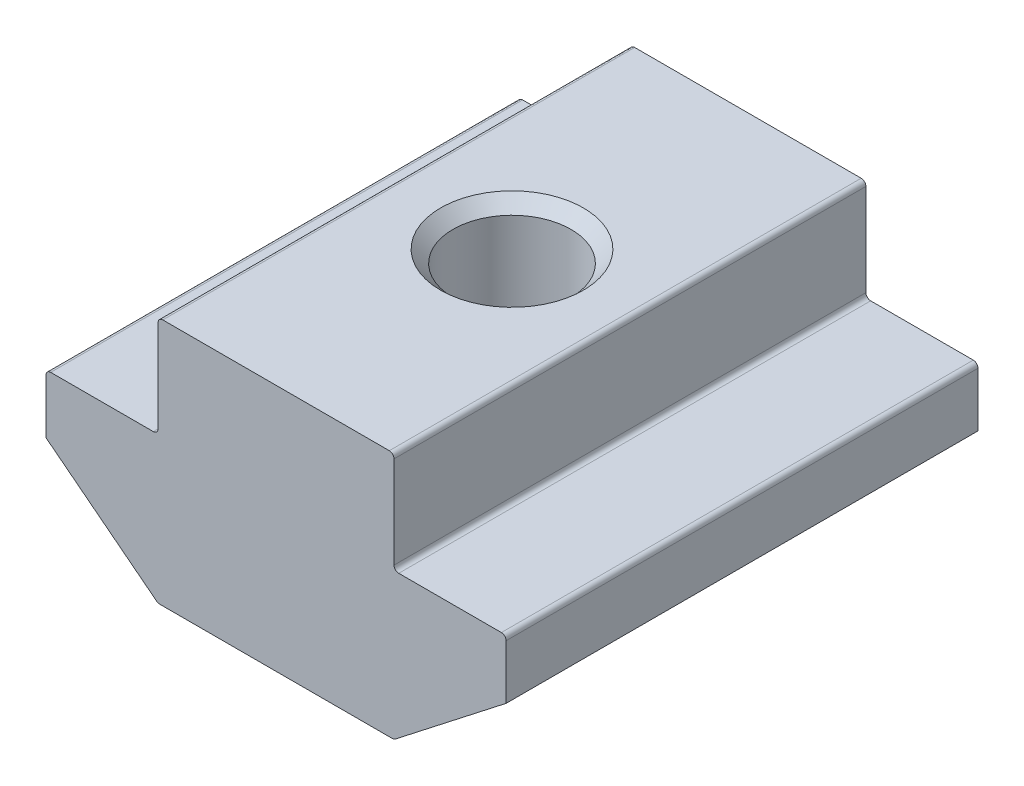
ISO-10303-21;
HEADER;
FILE_DESCRIPTION(('STEP AP214'),'2;1');
FILE_NAME('part.step','',(''),(''),'','','');
FILE_SCHEMA(('AUTOMOTIVE_DESIGN { 1 0 10303 214 1 1 1 1 }'));
ENDSEC;
DATA;
#1=APPLICATION_CONTEXT('core data for automotive mechanical design processes');
#2=APPLICATION_PROTOCOL_DEFINITION('international standard','automotive_design',2000,#1);
#3=PRODUCT_CONTEXT('',#1,'mechanical');
#4=PRODUCT('Part','Part','',(#3));
#5=PRODUCT_RELATED_PRODUCT_CATEGORY('part','',(#4));
#6=PRODUCT_DEFINITION_FORMATION('','',#4);
#7=PRODUCT_DEFINITION_CONTEXT('part definition',#1,'design');
#8=PRODUCT_DEFINITION('design','',#6,#7);
#9=PRODUCT_DEFINITION_SHAPE('','',#8);
#10=(LENGTH_UNIT() NAMED_UNIT(*) SI_UNIT(.MILLI.,.METRE.));
#11=(NAMED_UNIT(*) PLANE_ANGLE_UNIT() SI_UNIT($,.RADIAN.));
#12=(NAMED_UNIT(*) SI_UNIT($,.STERADIAN.) SOLID_ANGLE_UNIT());
#13=UNCERTAINTY_MEASURE_WITH_UNIT(LENGTH_MEASURE(1.E-05),#10,'distance_accuracy_value','');
#14=(GEOMETRIC_REPRESENTATION_CONTEXT(3) GLOBAL_UNCERTAINTY_ASSIGNED_CONTEXT((#13)) GLOBAL_UNIT_ASSIGNED_CONTEXT((#10,
#11,#12)) REPRESENTATION_CONTEXT('',''));
#15=CARTESIAN_POINT('',(0.,0.,0.));
#16=DIRECTION('',(0.,0.,1.));
#17=DIRECTION('',(1.,0.,0.));
#18=AXIS2_PLACEMENT_3D('',#15,#16,#17);
#19=CARTESIAN_POINT('',(-5.,0.,10.));
#20=DIRECTION('',(1.,0.,0.));
#21=DIRECTION('',(0.,1.,0.));
#22=AXIS2_PLACEMENT_3D('',#19,#20,#21);
#23=PLANE('',#22);
#24=DIRECTION('',(0.,-1.,0.));
#25=VECTOR('',#24,1.);
#26=CARTESIAN_POINT('',(-5.,0.,10.));
#27=LINE('',#26,#25);
#28=CARTESIAN_POINT('',(-5.,-0.200000000000003,10.));
#29=VERTEX_POINT('',#28);
#30=CARTESIAN_POINT('',(-5.,-4.1,10.));
#31=VERTEX_POINT('',#30);
#32=EDGE_CURVE('E234',#29,#31,#27,.T.);
#33=ORIENTED_EDGE('',*,*,#32,.F.);
#34=DIRECTION('',(0.,0.,-1.));
#35=VECTOR('',#34,1.);
#36=CARTESIAN_POINT('',(-5.,-0.200000000000003,10.));
#37=LINE('',#36,#35);
#38=CARTESIAN_POINT('',(-5.,-0.200000000000003,-10.));
#39=VERTEX_POINT('',#38);
#40=EDGE_CURVE('E285',#29,#39,#37,.T.);
#41=ORIENTED_EDGE('',*,*,#40,.T.);
#42=DIRECTION('',(0.,-1.,0.));
#43=VECTOR('',#42,1.);
#44=CARTESIAN_POINT('',(-5.,0.,-10.));
#45=LINE('',#44,#43);
#46=CARTESIAN_POINT('',(-5.,-4.1,-10.));
#47=VERTEX_POINT('',#46);
#48=EDGE_CURVE('E208',#39,#47,#45,.T.);
#49=ORIENTED_EDGE('',*,*,#48,.T.);
#50=DIRECTION('',(0.,0.,-1.));
#51=VECTOR('',#50,1.);
#52=CARTESIAN_POINT('',(-5.,-4.1,10.));
#53=LINE('',#52,#51);
#54=EDGE_CURVE('E283',#47,#31,#53,.F.);
#55=ORIENTED_EDGE('',*,*,#54,.T.);
#56=EDGE_LOOP('',(#33,#41,#49,#55));
#57=FACE_BOUND('',#56,.T.);
#58=ADVANCED_FACE('F37',(#57),#23,.F.);
#59=CARTESIAN_POINT('',(-5.,-4.3,10.));
#60=DIRECTION('',(0.,-1.,0.));
#61=DIRECTION('',(1.,0.,0.));
#62=AXIS2_PLACEMENT_3D('',#59,#60,#61);
#63=PLANE('',#62);
#64=DIRECTION('',(-1.,0.,0.));
#65=VECTOR('',#64,1.);
#66=CARTESIAN_POINT('',(-5.,-4.3,-10.));
#67=LINE('',#66,#65);
#68=CARTESIAN_POINT('',(-5.2,-4.3,-10.));
#69=VERTEX_POINT('',#68);
#70=CARTESIAN_POINT('',(-9.55,-4.3,-10.));
#71=VERTEX_POINT('',#70);
#72=EDGE_CURVE('E211',#69,#71,#67,.T.);
#73=ORIENTED_EDGE('',*,*,#72,.T.);
#74=DIRECTION('',(0.,0.,-1.));
#75=VECTOR('',#74,1.);
#76=CARTESIAN_POINT('',(-9.55,-4.3,10.));
#77=LINE('',#76,#75);
#78=CARTESIAN_POINT('',(-9.55,-4.3,10.));
#79=VERTEX_POINT('',#78);
#80=EDGE_CURVE('E293',#71,#79,#77,.F.);
#81=ORIENTED_EDGE('',*,*,#80,.T.);
#82=DIRECTION('',(-1.,0.,0.));
#83=VECTOR('',#82,1.);
#84=CARTESIAN_POINT('',(-5.,-4.3,10.));
#85=LINE('',#84,#83);
#86=CARTESIAN_POINT('',(-5.2,-4.3,10.));
#87=VERTEX_POINT('',#86);
#88=EDGE_CURVE('E175',#87,#79,#85,.T.);
#89=ORIENTED_EDGE('',*,*,#88,.F.);
#90=DIRECTION('',(0.,0.,-1.));
#91=VECTOR('',#90,1.);
#92=CARTESIAN_POINT('',(-5.2,-4.3,-10.));
#93=LINE('',#92,#91);
#94=EDGE_CURVE('E290',#87,#69,#93,.T.);
#95=ORIENTED_EDGE('',*,*,#94,.T.);
#96=EDGE_LOOP('',(#73,#81,#89,#95));
#97=FACE_BOUND('',#96,.T.);
#98=ADVANCED_FACE('F313',(#97),#63,.F.);
#99=CARTESIAN_POINT('',(-9.75,-4.3,10.));
#100=DIRECTION('',(1.,0.,0.));
#101=DIRECTION('',(0.,0.,-1.));
#102=AXIS2_PLACEMENT_3D('',#99,#100,#101);
#103=PLANE('',#102);
#104=DIRECTION('',(0.,-1.,0.));
#105=VECTOR('',#104,1.);
#106=CARTESIAN_POINT('',(-9.75,-4.3,10.));
#107=LINE('',#106,#105);
#108=CARTESIAN_POINT('',(-9.75,-4.5,10.));
#109=VERTEX_POINT('',#108);
#110=CARTESIAN_POINT('',(-9.75,-6.8,10.));
#111=VERTEX_POINT('',#110);
#112=EDGE_CURVE('E162',#109,#111,#107,.T.);
#113=ORIENTED_EDGE('',*,*,#112,.F.);
#114=DIRECTION('',(0.,0.,-1.));
#115=VECTOR('',#114,1.);
#116=CARTESIAN_POINT('',(-9.75,-4.5,10.));
#117=LINE('',#116,#115);
#118=CARTESIAN_POINT('',(-9.75,-4.5,-10.));
#119=VERTEX_POINT('',#118);
#120=EDGE_CURVE('E288',#109,#119,#117,.T.);
#121=ORIENTED_EDGE('',*,*,#120,.T.);
#122=DIRECTION('',(0.,-1.,0.));
#123=VECTOR('',#122,1.);
#124=CARTESIAN_POINT('',(-9.75,-4.3,-10.));
#125=LINE('',#124,#123);
#126=CARTESIAN_POINT('',(-9.75,-6.8,-10.));
#127=VERTEX_POINT('',#126);
#128=EDGE_CURVE('E181',#119,#127,#125,.T.);
#129=ORIENTED_EDGE('',*,*,#128,.T.);
#130=DIRECTION('',(0.,0.,-1.));
#131=VECTOR('',#130,1.);
#132=CARTESIAN_POINT('',(-9.75,-6.8,10.));
#133=LINE('',#132,#131);
#134=EDGE_CURVE('E178',#111,#127,#133,.T.);
#135=ORIENTED_EDGE('',*,*,#134,.F.);
#136=EDGE_LOOP('',(#113,#121,#129,#135));
#137=FACE_BOUND('',#136,.T.);
#138=ADVANCED_FACE('F179',(#137),#103,.F.);
#139=CARTESIAN_POINT('',(-9.75,-6.8,10.));
#140=DIRECTION('',(0.614515361098146,0.788904855463836,0.));
#141=DIRECTION('',(-0.788904855463836,0.614515361098146,0.));
#142=AXIS2_PLACEMENT_3D('',#139,#140,#141);
#143=PLANE('',#142);
#144=DIRECTION('',(0.788904855463836,-0.614515361098146,0.));
#145=VECTOR('',#144,1.);
#146=CARTESIAN_POINT('',(-9.75,-6.8,-10.));
#147=LINE('',#146,#145);
#148=CARTESIAN_POINT('',(-5.05420010467821,-10.4577809710928,-10.));
#149=VERTEX_POINT('',#148);
#150=EDGE_CURVE('E216',#127,#149,#147,.T.);
#151=ORIENTED_EDGE('',*,*,#150,.T.);
#152=DIRECTION('',(0.,0.,-1.));
#153=VECTOR('',#152,1.);
#154=CARTESIAN_POINT('',(-5.05420010467821,-10.4577809710928,10.));
#155=LINE('',#154,#153);
#156=CARTESIAN_POINT('',(-5.05420010467821,-10.4577809710928,10.));
#157=VERTEX_POINT('',#156);
#158=EDGE_CURVE('E190',#149,#157,#155,.F.);
#159=ORIENTED_EDGE('',*,*,#158,.T.);
#160=DIRECTION('',(0.788904855463836,-0.614515361098146,0.));
#161=VECTOR('',#160,1.);
#162=CARTESIAN_POINT('',(-9.75,-6.8,10.));
#163=LINE('',#162,#161);
#164=EDGE_CURVE('E167',#111,#157,#163,.T.);
#165=ORIENTED_EDGE('',*,*,#164,.F.);
#166=ORIENTED_EDGE('',*,*,#134,.T.);
#167=EDGE_LOOP('',(#151,#159,#165,#166));
#168=FACE_BOUND('',#167,.T.);
#169=ADVANCED_FACE('F188',(#168),#143,.F.);
#170=CARTESIAN_POINT('',(-5.,-10.5,10.));
#171=DIRECTION('',(0.,1.,0.));
#172=DIRECTION('',(0.,0.,1.));
#173=AXIS2_PLACEMENT_3D('',#170,#171,#172);
#174=PLANE('',#173);
#175=CARTESIAN_POINT('',(0.,-10.5,0.));
#176=DIRECTION('',(0.,1.,0.));
#177=DIRECTION('',(0.,0.,1.));
#178=AXIS2_PLACEMENT_3D('',#175,#176,#177);
#179=CIRCLE('',#178,3.025);
#180=CARTESIAN_POINT('',(0.,-10.5,3.025));
#181=VERTEX_POINT('',#180);
#182=EDGE_CURVE('E325',#181,#181,#179,.T.);
#183=ORIENTED_EDGE('',*,*,#182,.T.);
#184=EDGE_LOOP('',(#183));
#185=FACE_BOUND('',#184,.T.);
#186=DIRECTION('',(1.,0.,0.));
#187=VECTOR('',#186,1.);
#188=CARTESIAN_POINT('',(-5.,-10.5,-10.));
#189=LINE('',#188,#187);
#190=CARTESIAN_POINT('',(-4.93129703245858,-10.5,-10.));
#191=VERTEX_POINT('',#190);
#192=CARTESIAN_POINT('',(4.93129703245858,-10.5,-10.));
#193=VERTEX_POINT('',#192);
#194=EDGE_CURVE('E218',#191,#193,#189,.T.);
#195=ORIENTED_EDGE('',*,*,#194,.T.);
#196=DIRECTION('',(0.,0.,-1.));
#197=VECTOR('',#196,1.);
#198=CARTESIAN_POINT('',(4.93129703245858,-10.5,10.));
#199=LINE('',#198,#197);
#200=CARTESIAN_POINT('',(4.93129703245858,-10.5,10.));
#201=VERTEX_POINT('',#200);
#202=EDGE_CURVE('E254',#193,#201,#199,.F.);
#203=ORIENTED_EDGE('',*,*,#202,.T.);
#204=DIRECTION('',(1.,0.,0.));
#205=VECTOR('',#204,1.);
#206=CARTESIAN_POINT('',(-5.,-10.5,10.));
#207=LINE('',#206,#205);
#208=CARTESIAN_POINT('',(-4.93129703245858,-10.5,10.));
#209=VERTEX_POINT('',#208);
#210=EDGE_CURVE('E191',#209,#201,#207,.T.);
#211=ORIENTED_EDGE('',*,*,#210,.F.);
#212=DIRECTION('',(0.,0.,-1.));
#213=VECTOR('',#212,1.);
#214=CARTESIAN_POINT('',(-4.93129703245858,-10.5,10.));
#215=LINE('',#214,#213);
#216=EDGE_CURVE('E251',#209,#191,#215,.T.);
#217=ORIENTED_EDGE('',*,*,#216,.T.);
#218=EDGE_LOOP('',(#195,#203,#211,#217));
#219=FACE_BOUND('',#218,.T.);
#220=ADVANCED_FACE('F329',(#185,#219),#174,.F.);
#221=CARTESIAN_POINT('',(9.75,-6.8,10.));
#222=DIRECTION('',(-0.614515361098146,0.788904855463836,0.));
#223=DIRECTION('',(-0.788904855463836,-0.614515361098146,0.));
#224=AXIS2_PLACEMENT_3D('',#221,#222,#223);
#225=PLANE('',#224);
#226=DIRECTION('',(0.788904855463836,0.614515361098146,0.));
#227=VECTOR('',#226,1.);
#228=CARTESIAN_POINT('',(9.75,-6.8,10.));
#229=LINE('',#228,#227);
#230=CARTESIAN_POINT('',(5.05420010467821,-10.4577809710928,10.));
#231=VERTEX_POINT('',#230);
#232=CARTESIAN_POINT('',(9.75,-6.8,10.));
#233=VERTEX_POINT('',#232);
#234=EDGE_CURVE('E193',#231,#233,#229,.T.);
#235=ORIENTED_EDGE('',*,*,#234,.F.);
#236=DIRECTION('',(0.,0.,-1.));
#237=VECTOR('',#236,1.);
#238=CARTESIAN_POINT('',(5.05420010467821,-10.4577809710928,10.));
#239=LINE('',#238,#237);
#240=CARTESIAN_POINT('',(5.05420010467821,-10.4577809710928,-10.));
#241=VERTEX_POINT('',#240);
#242=EDGE_CURVE('E185',#231,#241,#239,.T.);
#243=ORIENTED_EDGE('',*,*,#242,.T.);
#244=DIRECTION('',(0.788904855463836,0.614515361098146,0.));
#245=VECTOR('',#244,1.);
#246=CARTESIAN_POINT('',(9.75,-6.8,-10.));
#247=LINE('',#246,#245);
#248=CARTESIAN_POINT('',(9.75,-6.8,-10.));
#249=VERTEX_POINT('',#248);
#250=EDGE_CURVE('E221',#241,#249,#247,.T.);
#251=ORIENTED_EDGE('',*,*,#250,.T.);
#252=DIRECTION('',(0.,0.,-1.));
#253=VECTOR('',#252,1.);
#254=CARTESIAN_POINT('',(9.75,-6.8,10.));
#255=LINE('',#254,#253);
#256=EDGE_CURVE('E186',#233,#249,#255,.T.);
#257=ORIENTED_EDGE('',*,*,#256,.F.);
#258=EDGE_LOOP('',(#235,#243,#251,#257));
#259=FACE_BOUND('',#258,.T.);
#260=ADVANCED_FACE('F385',(#259),#225,.F.);
#261=CARTESIAN_POINT('',(9.75,-4.3,10.));
#262=DIRECTION('',(-1.,0.,0.));
#263=DIRECTION('',(0.,0.,1.));
#264=AXIS2_PLACEMENT_3D('',#261,#262,#263);
#265=PLANE('',#264);
#266=DIRECTION('',(0.,1.,0.));
#267=VECTOR('',#266,1.);
#268=CARTESIAN_POINT('',(9.75,-4.3,-10.));
#269=LINE('',#268,#267);
#270=CARTESIAN_POINT('',(9.75,-4.5,-10.));
#271=VERTEX_POINT('',#270);
#272=EDGE_CURVE('E223',#249,#271,#269,.T.);
#273=ORIENTED_EDGE('',*,*,#272,.T.);
#274=DIRECTION('',(0.,0.,-1.));
#275=VECTOR('',#274,1.);
#276=CARTESIAN_POINT('',(9.75,-4.5,10.));
#277=LINE('',#276,#275);
#278=CARTESIAN_POINT('',(9.75,-4.5,10.));
#279=VERTEX_POINT('',#278);
#280=EDGE_CURVE('E272',#271,#279,#277,.F.);
#281=ORIENTED_EDGE('',*,*,#280,.T.);
#282=DIRECTION('',(0.,1.,0.));
#283=VECTOR('',#282,1.);
#284=CARTESIAN_POINT('',(9.75,-4.3,10.));
#285=LINE('',#284,#283);
#286=EDGE_CURVE('E198',#233,#279,#285,.T.);
#287=ORIENTED_EDGE('',*,*,#286,.F.);
#288=ORIENTED_EDGE('',*,*,#256,.T.);
#289=EDGE_LOOP('',(#273,#281,#287,#288));
#290=FACE_BOUND('',#289,.T.);
#291=ADVANCED_FACE('F380',(#290),#265,.F.);
#292=CARTESIAN_POINT('',(5.,-4.3,10.));
#293=DIRECTION('',(0.,-1.,0.));
#294=DIRECTION('',(1.,0.,0.));
#295=AXIS2_PLACEMENT_3D('',#292,#293,#294);
#296=PLANE('',#295);
#297=DIRECTION('',(-1.,0.,0.));
#298=VECTOR('',#297,1.);
#299=CARTESIAN_POINT('',(5.,-4.3,10.));
#300=LINE('',#299,#298);
#301=CARTESIAN_POINT('',(9.55,-4.3,10.));
#302=VERTEX_POINT('',#301);
#303=CARTESIAN_POINT('',(5.2,-4.3,10.));
#304=VERTEX_POINT('',#303);
#305=EDGE_CURVE('E201',#302,#304,#300,.T.);
#306=ORIENTED_EDGE('',*,*,#305,.F.);
#307=DIRECTION('',(0.,0.,-1.));
#308=VECTOR('',#307,1.);
#309=CARTESIAN_POINT('',(9.55,-4.3,10.));
#310=LINE('',#309,#308);
#311=CARTESIAN_POINT('',(9.55,-4.3,-10.));
#312=VERTEX_POINT('',#311);
#313=EDGE_CURVE('E269',#302,#312,#310,.T.);
#314=ORIENTED_EDGE('',*,*,#313,.T.);
#315=DIRECTION('',(-1.,0.,0.));
#316=VECTOR('',#315,1.);
#317=CARTESIAN_POINT('',(5.,-4.3,-10.));
#318=LINE('',#317,#316);
#319=CARTESIAN_POINT('',(5.2,-4.3,-10.));
#320=VERTEX_POINT('',#319);
#321=EDGE_CURVE('E226',#312,#320,#318,.T.);
#322=ORIENTED_EDGE('',*,*,#321,.T.);
#323=DIRECTION('',(0.,0.,-1.));
#324=VECTOR('',#323,1.);
#325=CARTESIAN_POINT('',(5.2,-4.3,10.));
#326=LINE('',#325,#324);
#327=EDGE_CURVE('E267',#320,#304,#326,.F.);
#328=ORIENTED_EDGE('',*,*,#327,.T.);
#329=EDGE_LOOP('',(#306,#314,#322,#328));
#330=FACE_BOUND('',#329,.T.);
#331=ADVANCED_FACE('F372',(#330),#296,.F.);
#332=CARTESIAN_POINT('',(5.,0.,10.));
#333=DIRECTION('',(-1.,0.,0.));
#334=DIRECTION('',(0.,-1.,0.));
#335=AXIS2_PLACEMENT_3D('',#332,#333,#334);
#336=PLANE('',#335);
#337=DIRECTION('',(0.,1.,0.));
#338=VECTOR('',#337,1.);
#339=CARTESIAN_POINT('',(5.,0.,10.));
#340=LINE('',#339,#338);
#341=CARTESIAN_POINT('',(5.,-4.1,10.));
#342=VERTEX_POINT('',#341);
#343=CARTESIAN_POINT('',(5.,-0.199999999999997,10.));
#344=VERTEX_POINT('',#343);
#345=EDGE_CURVE('E204',#342,#344,#340,.T.);
#346=ORIENTED_EDGE('',*,*,#345,.F.);
#347=DIRECTION('',(0.,0.,-1.));
#348=VECTOR('',#347,1.);
#349=CARTESIAN_POINT('',(5.,-4.1,-10.));
#350=LINE('',#349,#348);
#351=CARTESIAN_POINT('',(5.,-4.1,-10.));
#352=VERTEX_POINT('',#351);
#353=EDGE_CURVE('E276',#342,#352,#350,.T.);
#354=ORIENTED_EDGE('',*,*,#353,.T.);
#355=DIRECTION('',(0.,1.,0.));
#356=VECTOR('',#355,1.);
#357=CARTESIAN_POINT('',(5.,0.,-10.));
#358=LINE('',#357,#356);
#359=CARTESIAN_POINT('',(5.,-0.199999999999997,-10.));
#360=VERTEX_POINT('',#359);
#361=EDGE_CURVE('E229',#352,#360,#358,.T.);
#362=ORIENTED_EDGE('',*,*,#361,.T.);
#363=DIRECTION('',(0.,0.,-1.));
#364=VECTOR('',#363,1.);
#365=CARTESIAN_POINT('',(5.,-0.199999999999997,10.));
#366=LINE('',#365,#364);
#367=EDGE_CURVE('E274',#360,#344,#366,.F.);
#368=ORIENTED_EDGE('',*,*,#367,.T.);
#369=EDGE_LOOP('',(#346,#354,#362,#368));
#370=FACE_BOUND('',#369,.T.);
#371=ADVANCED_FACE('F353',(#370),#336,.F.);
#372=CARTESIAN_POINT('',(5.,0.,10.));
#373=DIRECTION('',(0.,-1.,0.));
#374=DIRECTION('',(1.,0.,0.));
#375=AXIS2_PLACEMENT_3D('',#372,#373,#374);
#376=PLANE('',#375);
#377=CARTESIAN_POINT('',(0.,0.,0.));
#378=DIRECTION('',(0.,1.,0.));
#379=DIRECTION('',(0.,0.,1.));
#380=AXIS2_PLACEMENT_3D('',#377,#378,#379);
#381=CIRCLE('',#380,3.025);
#382=CARTESIAN_POINT('',(0.,0.,3.025));
#383=VERTEX_POINT('',#382);
#384=EDGE_CURVE('E322',#383,#383,#381,.T.);
#385=ORIENTED_EDGE('',*,*,#384,.F.);
#386=EDGE_LOOP('',(#385));
#387=FACE_BOUND('',#386,.T.);
#388=DIRECTION('',(-1.,0.,0.));
#389=VECTOR('',#388,1.);
#390=CARTESIAN_POINT('',(5.,0.,10.));
#391=LINE('',#390,#389);
#392=CARTESIAN_POINT('',(4.8,0.,10.));
#393=VERTEX_POINT('',#392);
#394=CARTESIAN_POINT('',(-4.8,0.,10.));
#395=VERTEX_POINT('',#394);
#396=EDGE_CURVE('E206',#393,#395,#391,.T.);
#397=ORIENTED_EDGE('',*,*,#396,.F.);
#398=DIRECTION('',(0.,0.,-1.));
#399=VECTOR('',#398,1.);
#400=CARTESIAN_POINT('',(4.8,0.,10.));
#401=LINE('',#400,#399);
#402=CARTESIAN_POINT('',(4.8,0.,-10.));
#403=VERTEX_POINT('',#402);
#404=EDGE_CURVE('E280',#393,#403,#401,.T.);
#405=ORIENTED_EDGE('',*,*,#404,.T.);
#406=DIRECTION('',(-1.,0.,0.));
#407=VECTOR('',#406,1.);
#408=CARTESIAN_POINT('',(5.,0.,-10.));
#409=LINE('',#408,#407);
#410=CARTESIAN_POINT('',(-4.8,0.,-10.));
#411=VERTEX_POINT('',#410);
#412=EDGE_CURVE('E232',#403,#411,#409,.T.);
#413=ORIENTED_EDGE('',*,*,#412,.T.);
#414=DIRECTION('',(0.,0.,-1.));
#415=VECTOR('',#414,1.);
#416=CARTESIAN_POINT('',(-4.8,0.,10.));
#417=LINE('',#416,#415);
#418=EDGE_CURVE('E52',#411,#395,#417,.F.);
#419=ORIENTED_EDGE('',*,*,#418,.T.);
#420=EDGE_LOOP('',(#397,#405,#413,#419));
#421=FACE_BOUND('',#420,.T.);
#422=ADVANCED_FACE('F351',(#387,#421),#376,.F.);
#423=CARTESIAN_POINT('',(0.,0.,10.));
#424=DIRECTION('',(0.,0.,-1.));
#425=DIRECTION('',(-1.,0.,0.));
#426=AXIS2_PLACEMENT_3D('',#423,#424,#425);
#427=PLANE('',#426);
#428=ORIENTED_EDGE('',*,*,#210,.T.);
#429=CARTESIAN_POINT('',(4.93129703245858,-10.3,10.));
#430=DIRECTION('',(0.,0.,-1.));
#431=DIRECTION('',(-1.,0.,0.));
#432=AXIS2_PLACEMENT_3D('',#429,#430,#431);
#433=CIRCLE('',#432,0.2);
#434=EDGE_CURVE('E264',#201,#231,#433,.F.);
#435=ORIENTED_EDGE('',*,*,#434,.T.);
#436=ORIENTED_EDGE('',*,*,#234,.T.);
#437=ORIENTED_EDGE('',*,*,#286,.T.);
#438=CARTESIAN_POINT('',(9.55,-4.5,10.));
#439=DIRECTION('',(0.,0.,-1.));
#440=DIRECTION('',(-1.,0.,0.));
#441=AXIS2_PLACEMENT_3D('',#438,#439,#440);
#442=CIRCLE('',#441,0.2);
#443=EDGE_CURVE('E260',#279,#302,#442,.F.);
#444=ORIENTED_EDGE('',*,*,#443,.T.);
#445=ORIENTED_EDGE('',*,*,#305,.T.);
#446=CARTESIAN_POINT('',(5.2,-4.1,10.));
#447=DIRECTION('',(0.,0.,-1.));
#448=DIRECTION('',(-1.,0.,0.));
#449=AXIS2_PLACEMENT_3D('',#446,#447,#448);
#450=CIRCLE('',#449,0.2);
#451=EDGE_CURVE('E297',#304,#342,#450,.T.);
#452=ORIENTED_EDGE('',*,*,#451,.T.);
#453=ORIENTED_EDGE('',*,*,#345,.T.);
#454=CARTESIAN_POINT('',(4.8,-0.199999999999998,10.));
#455=DIRECTION('',(0.,0.,-1.));
#456=DIRECTION('',(-1.,0.,0.));
#457=AXIS2_PLACEMENT_3D('',#454,#455,#456);
#458=CIRCLE('',#457,0.2);
#459=EDGE_CURVE('E59',#344,#393,#458,.F.);
#460=ORIENTED_EDGE('',*,*,#459,.T.);
#461=ORIENTED_EDGE('',*,*,#396,.T.);
#462=CARTESIAN_POINT('',(-4.8,-0.200000000000003,10.));
#463=DIRECTION('',(0.,0.,-1.));
#464=DIRECTION('',(-1.,0.,0.));
#465=AXIS2_PLACEMENT_3D('',#462,#463,#464);
#466=CIRCLE('',#465,0.2);
#467=EDGE_CURVE('E257',#395,#29,#466,.F.);
#468=ORIENTED_EDGE('',*,*,#467,.T.);
#469=ORIENTED_EDGE('',*,*,#32,.T.);
#470=CARTESIAN_POINT('',(-5.2,-4.1,10.));
#471=DIRECTION('',(0.,0.,-1.));
#472=DIRECTION('',(-1.,0.,0.));
#473=AXIS2_PLACEMENT_3D('',#470,#471,#472);
#474=CIRCLE('',#473,0.2);
#475=EDGE_CURVE('E11',#31,#87,#474,.T.);
#476=ORIENTED_EDGE('',*,*,#475,.T.);
#477=ORIENTED_EDGE('',*,*,#88,.T.);
#478=CARTESIAN_POINT('',(-9.55,-4.5,10.));
#479=DIRECTION('',(0.,0.,-1.));
#480=DIRECTION('',(-1.,0.,0.));
#481=AXIS2_PLACEMENT_3D('',#478,#479,#480);
#482=CIRCLE('',#481,0.2);
#483=EDGE_CURVE('E171',#79,#109,#482,.F.);
#484=ORIENTED_EDGE('',*,*,#483,.T.);
#485=ORIENTED_EDGE('',*,*,#112,.T.);
#486=ORIENTED_EDGE('',*,*,#164,.T.);
#487=CARTESIAN_POINT('',(-4.93129703245858,-10.3,10.));
#488=DIRECTION('',(0.,0.,-1.));
#489=DIRECTION('',(-1.,0.,0.));
#490=AXIS2_PLACEMENT_3D('',#487,#488,#489);
#491=CIRCLE('',#490,0.2);
#492=EDGE_CURVE('E262',#157,#209,#491,.F.);
#493=ORIENTED_EDGE('',*,*,#492,.T.);
#494=EDGE_LOOP('',(#428,#435,#436,#437,#444,#445,#452,#453,#460,#461,#468,#469,#476,#477,#484,
#485,#486,#493));
#495=FACE_BOUND('',#494,.T.);
#496=ADVANCED_FACE('F165',(#495),#427,.F.);
#497=CARTESIAN_POINT('',(0.,0.,-10.));
#498=DIRECTION('',(0.,0.,-1.));
#499=DIRECTION('',(-1.,0.,0.));
#500=AXIS2_PLACEMENT_3D('',#497,#498,#499);
#501=PLANE('',#500);
#502=ORIENTED_EDGE('',*,*,#250,.F.);
#503=CARTESIAN_POINT('',(4.93129703245858,-10.3,-10.));
#504=DIRECTION('',(0.,0.,-1.));
#505=DIRECTION('',(-1.,0.,0.));
#506=AXIS2_PLACEMENT_3D('',#503,#504,#505);
#507=CIRCLE('',#506,0.2);
#508=EDGE_CURVE('E249',#241,#193,#507,.T.);
#509=ORIENTED_EDGE('',*,*,#508,.T.);
#510=ORIENTED_EDGE('',*,*,#194,.F.);
#511=CARTESIAN_POINT('',(-4.93129703245858,-10.3,-10.));
#512=DIRECTION('',(0.,0.,-1.));
#513=DIRECTION('',(-1.,0.,0.));
#514=AXIS2_PLACEMENT_3D('',#511,#512,#513);
#515=CIRCLE('',#514,0.2);
#516=EDGE_CURVE('E247',#191,#149,#515,.T.);
#517=ORIENTED_EDGE('',*,*,#516,.T.);
#518=ORIENTED_EDGE('',*,*,#150,.F.);
#519=ORIENTED_EDGE('',*,*,#128,.F.);
#520=CARTESIAN_POINT('',(-9.55,-4.5,-10.));
#521=DIRECTION('',(0.,0.,-1.));
#522=DIRECTION('',(-1.,0.,0.));
#523=AXIS2_PLACEMENT_3D('',#520,#521,#522);
#524=CIRCLE('',#523,0.2);
#525=EDGE_CURVE('E239',#119,#71,#524,.T.);
#526=ORIENTED_EDGE('',*,*,#525,.T.);
#527=ORIENTED_EDGE('',*,*,#72,.F.);
#528=CARTESIAN_POINT('',(-5.2,-4.1,-10.));
#529=DIRECTION('',(0.,0.,-1.));
#530=DIRECTION('',(-1.,0.,0.));
#531=AXIS2_PLACEMENT_3D('',#528,#529,#530);
#532=CIRCLE('',#531,0.2);
#533=EDGE_CURVE('E45',#69,#47,#532,.F.);
#534=ORIENTED_EDGE('',*,*,#533,.T.);
#535=ORIENTED_EDGE('',*,*,#48,.F.);
#536=CARTESIAN_POINT('',(-4.8,-0.200000000000003,-10.));
#537=DIRECTION('',(0.,0.,-1.));
#538=DIRECTION('',(-1.,0.,0.));
#539=AXIS2_PLACEMENT_3D('',#536,#537,#538);
#540=CIRCLE('',#539,0.2);
#541=EDGE_CURVE('E241',#39,#411,#540,.T.);
#542=ORIENTED_EDGE('',*,*,#541,.T.);
#543=ORIENTED_EDGE('',*,*,#412,.F.);
#544=CARTESIAN_POINT('',(4.8,-0.199999999999998,-10.));
#545=DIRECTION('',(0.,0.,-1.));
#546=DIRECTION('',(-1.,0.,0.));
#547=AXIS2_PLACEMENT_3D('',#544,#545,#546);
#548=CIRCLE('',#547,0.2);
#549=EDGE_CURVE('E243',#403,#360,#548,.T.);
#550=ORIENTED_EDGE('',*,*,#549,.T.);
#551=ORIENTED_EDGE('',*,*,#361,.F.);
#552=CARTESIAN_POINT('',(5.2,-4.1,-10.));
#553=DIRECTION('',(0.,0.,-1.));
#554=DIRECTION('',(-1.,0.,0.));
#555=AXIS2_PLACEMENT_3D('',#552,#553,#554);
#556=CIRCLE('',#555,0.2);
#557=EDGE_CURVE('E295',#352,#320,#556,.F.);
#558=ORIENTED_EDGE('',*,*,#557,.T.);
#559=ORIENTED_EDGE('',*,*,#321,.F.);
#560=CARTESIAN_POINT('',(9.55,-4.5,-10.));
#561=DIRECTION('',(0.,0.,-1.));
#562=DIRECTION('',(-1.,0.,0.));
#563=AXIS2_PLACEMENT_3D('',#560,#561,#562);
#564=CIRCLE('',#563,0.2);
#565=EDGE_CURVE('E245',#312,#271,#564,.T.);
#566=ORIENTED_EDGE('',*,*,#565,.T.);
#567=ORIENTED_EDGE('',*,*,#272,.F.);
#568=EDGE_LOOP('',(#502,#509,#510,#517,#518,#519,#526,#527,#534,#535,#542,#543,#550,#551,#558,
#559,#566,#567));
#569=FACE_BOUND('',#568,.T.);
#570=ADVANCED_FACE('F302',(#569),#501,.T.);
#571=CARTESIAN_POINT('',(0.,-9.975,0.));
#572=DIRECTION('',(0.,-1.,0.));
#573=DIRECTION('',(0.,0.,-1.));
#574=AXIS2_PLACEMENT_3D('',#571,#572,#573);
#575=CONICAL_SURFACE('',#574,2.5,0.785398163397446);
#576=ORIENTED_EDGE('',*,*,#182,.F.);
#577=EDGE_LOOP('',(#576));
#578=FACE_BOUND('',#577,.T.);
#579=CARTESIAN_POINT('',(0.,-9.975,0.));
#580=DIRECTION('',(0.,1.,0.));
#581=DIRECTION('',(0.,0.,1.));
#582=AXIS2_PLACEMENT_3D('',#579,#580,#581);
#583=CIRCLE('',#582,2.5);
#584=CARTESIAN_POINT('',(0.,-9.975,2.5));
#585=VERTEX_POINT('',#584);
#586=EDGE_CURVE('E212',#585,#585,#583,.T.);
#587=ORIENTED_EDGE('',*,*,#586,.T.);
#588=EDGE_LOOP('',(#587));
#589=FACE_BOUND('',#588,.T.);
#590=ADVANCED_FACE('F332',(#578,#589),#575,.F.);
#591=CARTESIAN_POINT('',(0.,0.,0.));
#592=DIRECTION('',(0.,1.,0.));
#593=DIRECTION('',(0.,0.,1.));
#594=AXIS2_PLACEMENT_3D('',#591,#592,#593);
#595=CYLINDRICAL_SURFACE('',#594,2.5);
#596=ORIENTED_EDGE('',*,*,#586,.F.);
#597=EDGE_LOOP('',(#596));
#598=FACE_BOUND('',#597,.T.);
#599=CARTESIAN_POINT('',(0.,-0.524999999999999,0.));
#600=DIRECTION('',(0.,1.,0.));
#601=DIRECTION('',(0.,0.,1.));
#602=AXIS2_PLACEMENT_3D('',#599,#600,#601);
#603=CIRCLE('',#602,2.5);
#604=CARTESIAN_POINT('',(0.,-0.524999999999999,2.5));
#605=VERTEX_POINT('',#604);
#606=EDGE_CURVE('E319',#605,#605,#603,.T.);
#607=ORIENTED_EDGE('',*,*,#606,.T.);
#608=EDGE_LOOP('',(#607));
#609=FACE_BOUND('',#608,.T.);
#610=ADVANCED_FACE('F335',(#598,#609),#595,.F.);
#611=CARTESIAN_POINT('',(0.,0.,0.));
#612=DIRECTION('',(0.,1.,0.));
#613=DIRECTION('',(0.,0.,1.));
#614=AXIS2_PLACEMENT_3D('',#611,#612,#613);
#615=CONICAL_SURFACE('',#614,3.025,0.78539816339745);
#616=ORIENTED_EDGE('',*,*,#606,.F.);
#617=EDGE_LOOP('',(#616));
#618=FACE_BOUND('',#617,.T.);
#619=ORIENTED_EDGE('',*,*,#384,.T.);
#620=EDGE_LOOP('',(#619));
#621=FACE_BOUND('',#620,.T.);
#622=ADVANCED_FACE('F341',(#618,#621),#615,.F.);
#623=CARTESIAN_POINT('',(4.93129703245858,-10.3,10.));
#624=DIRECTION('',(0.,0.,-1.));
#625=DIRECTION('',(-1.,0.,0.));
#626=AXIS2_PLACEMENT_3D('',#623,#624,#625);
#627=CYLINDRICAL_SURFACE('',#626,0.2);
#628=ORIENTED_EDGE('',*,*,#434,.F.);
#629=ORIENTED_EDGE('',*,*,#202,.F.);
#630=ORIENTED_EDGE('',*,*,#508,.F.);
#631=ORIENTED_EDGE('',*,*,#242,.F.);
#632=EDGE_LOOP('',(#628,#629,#630,#631));
#633=FACE_BOUND('',#632,.T.);
#634=ADVANCED_FACE('F347',(#633),#627,.T.);
#635=CARTESIAN_POINT('',(-4.93129703245858,-10.3,10.));
#636=DIRECTION('',(0.,0.,-1.));
#637=DIRECTION('',(-1.,0.,0.));
#638=AXIS2_PLACEMENT_3D('',#635,#636,#637);
#639=CYLINDRICAL_SURFACE('',#638,0.2);
#640=ORIENTED_EDGE('',*,*,#492,.F.);
#641=ORIENTED_EDGE('',*,*,#158,.F.);
#642=ORIENTED_EDGE('',*,*,#516,.F.);
#643=ORIENTED_EDGE('',*,*,#216,.F.);
#644=EDGE_LOOP('',(#640,#641,#642,#643));
#645=FACE_BOUND('',#644,.T.);
#646=ADVANCED_FACE('F394',(#645),#639,.T.);
#647=CARTESIAN_POINT('',(9.55,-4.5,10.));
#648=DIRECTION('',(0.,0.,-1.));
#649=DIRECTION('',(-1.,0.,0.));
#650=AXIS2_PLACEMENT_3D('',#647,#648,#649);
#651=CYLINDRICAL_SURFACE('',#650,0.2);
#652=ORIENTED_EDGE('',*,*,#443,.F.);
#653=ORIENTED_EDGE('',*,*,#280,.F.);
#654=ORIENTED_EDGE('',*,*,#565,.F.);
#655=ORIENTED_EDGE('',*,*,#313,.F.);
#656=EDGE_LOOP('',(#652,#653,#654,#655));
#657=FACE_BOUND('',#656,.T.);
#658=ADVANCED_FACE('F376',(#657),#651,.T.);
#659=CARTESIAN_POINT('',(5.2,-4.1,10.));
#660=DIRECTION('',(0.,0.,1.));
#661=DIRECTION('',(1.,0.,0.));
#662=AXIS2_PLACEMENT_3D('',#659,#660,#661);
#663=CYLINDRICAL_SURFACE('',#662,0.2);
#664=ORIENTED_EDGE('',*,*,#451,.F.);
#665=ORIENTED_EDGE('',*,*,#327,.F.);
#666=ORIENTED_EDGE('',*,*,#557,.F.);
#667=ORIENTED_EDGE('',*,*,#353,.F.);
#668=EDGE_LOOP('',(#664,#665,#666,#667));
#669=FACE_BOUND('',#668,.T.);
#670=ADVANCED_FACE('F367',(#669),#663,.F.);
#671=CARTESIAN_POINT('',(4.8,-0.199999999999998,10.));
#672=DIRECTION('',(0.,0.,-1.));
#673=DIRECTION('',(-1.,0.,0.));
#674=AXIS2_PLACEMENT_3D('',#671,#672,#673);
#675=CYLINDRICAL_SURFACE('',#674,0.2);
#676=ORIENTED_EDGE('',*,*,#459,.F.);
#677=ORIENTED_EDGE('',*,*,#367,.F.);
#678=ORIENTED_EDGE('',*,*,#549,.F.);
#679=ORIENTED_EDGE('',*,*,#404,.F.);
#680=EDGE_LOOP('',(#676,#677,#678,#679));
#681=FACE_BOUND('',#680,.T.);
#682=ADVANCED_FACE('F359',(#681),#675,.T.);
#683=CARTESIAN_POINT('',(-4.8,-0.200000000000003,10.));
#684=DIRECTION('',(0.,0.,-1.));
#685=DIRECTION('',(-1.,0.,0.));
#686=AXIS2_PLACEMENT_3D('',#683,#684,#685);
#687=CYLINDRICAL_SURFACE('',#686,0.2);
#688=ORIENTED_EDGE('',*,*,#467,.F.);
#689=ORIENTED_EDGE('',*,*,#418,.F.);
#690=ORIENTED_EDGE('',*,*,#541,.F.);
#691=ORIENTED_EDGE('',*,*,#40,.F.);
#692=EDGE_LOOP('',(#688,#689,#690,#691));
#693=FACE_BOUND('',#692,.T.);
#694=ADVANCED_FACE('F398',(#693),#687,.T.);
#695=CARTESIAN_POINT('',(-9.55,-4.5,10.));
#696=DIRECTION('',(0.,0.,-1.));
#697=DIRECTION('',(-1.,0.,0.));
#698=AXIS2_PLACEMENT_3D('',#695,#696,#697);
#699=CYLINDRICAL_SURFACE('',#698,0.2);
#700=ORIENTED_EDGE('',*,*,#483,.F.);
#701=ORIENTED_EDGE('',*,*,#80,.F.);
#702=ORIENTED_EDGE('',*,*,#525,.F.);
#703=ORIENTED_EDGE('',*,*,#120,.F.);
#704=EDGE_LOOP('',(#700,#701,#702,#703));
#705=FACE_BOUND('',#704,.T.);
#706=ADVANCED_FACE('F396',(#705),#699,.T.);
#707=CARTESIAN_POINT('',(-5.2,-4.1,10.));
#708=DIRECTION('',(0.,0.,1.));
#709=DIRECTION('',(1.,0.,0.));
#710=AXIS2_PLACEMENT_3D('',#707,#708,#709);
#711=CYLINDRICAL_SURFACE('',#710,0.2);
#712=ORIENTED_EDGE('',*,*,#475,.F.);
#713=ORIENTED_EDGE('',*,*,#54,.F.);
#714=ORIENTED_EDGE('',*,*,#533,.F.);
#715=ORIENTED_EDGE('',*,*,#94,.F.);
#716=EDGE_LOOP('',(#712,#713,#714,#715));
#717=FACE_BOUND('',#716,.T.);
#718=ADVANCED_FACE('F39',(#717),#711,.F.);
#719=CLOSED_SHELL('',(#58,#98,#138,#169,#220,#260,#291,#331,#371,#422,#496,#570,#590,#610,#622,
#634,#646,#658,#670,#682,#694,#706,#718));
#720=MANIFOLD_SOLID_BREP('B2',#719);
#721=ADVANCED_BREP_SHAPE_REPRESENTATION('',(#18,#720),#14);
#722=SHAPE_DEFINITION_REPRESENTATION(#9,#721);
ENDSEC;
END-ISO-10303-21;
